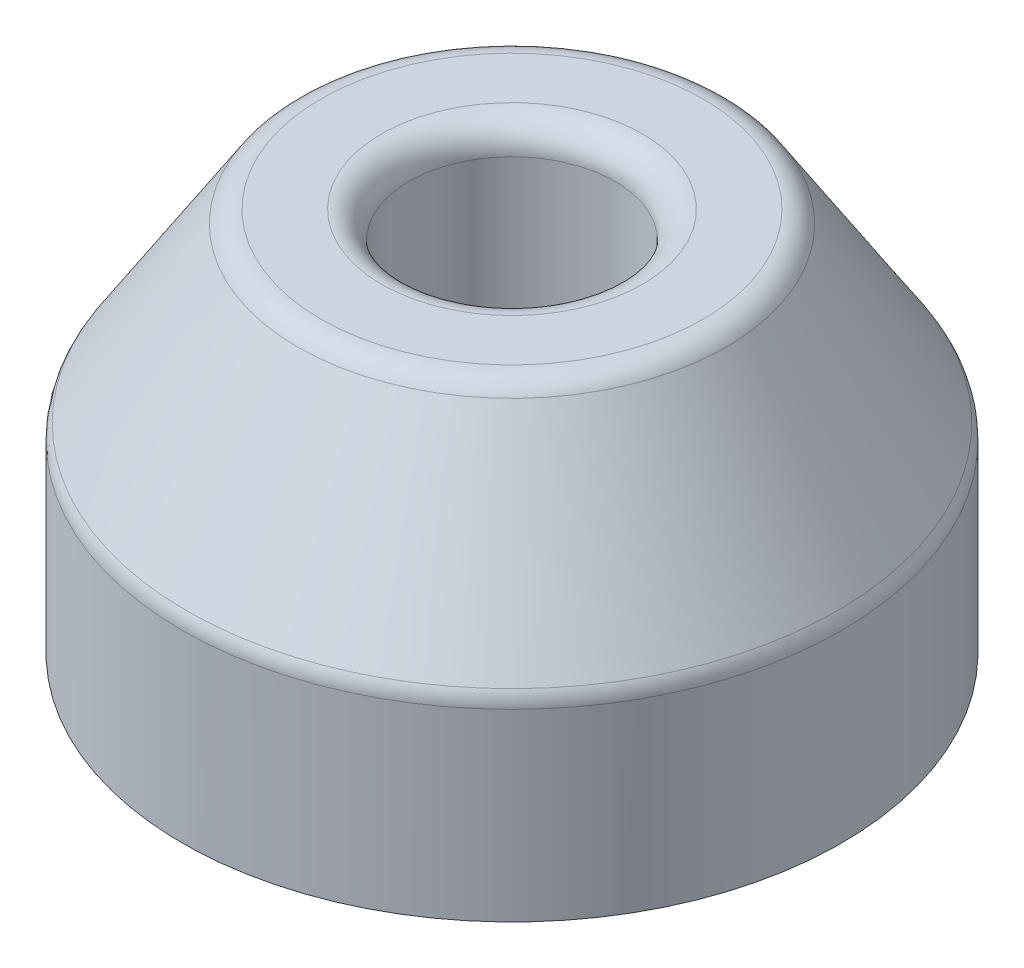
ISO-10303-21;
HEADER;
FILE_DESCRIPTION(('STEP AP214'),'2;1');
FILE_NAME('part.step','',(''),(''),'','','');
FILE_SCHEMA(('AUTOMOTIVE_DESIGN { 1 0 10303 214 1 1 1 1 }'));
ENDSEC;
DATA;
#1=APPLICATION_CONTEXT('core data for automotive mechanical design processes');
#2=APPLICATION_PROTOCOL_DEFINITION('international standard','automotive_design',2000,#1);
#3=PRODUCT_CONTEXT('',#1,'mechanical');
#4=PRODUCT('Part','Part','',(#3));
#5=PRODUCT_RELATED_PRODUCT_CATEGORY('part','',(#4));
#6=PRODUCT_DEFINITION_FORMATION('','',#4);
#7=PRODUCT_DEFINITION_CONTEXT('part definition',#1,'design');
#8=PRODUCT_DEFINITION('design','',#6,#7);
#9=PRODUCT_DEFINITION_SHAPE('','',#8);
#10=(LENGTH_UNIT() NAMED_UNIT(*) SI_UNIT(.MILLI.,.METRE.));
#11=(NAMED_UNIT(*) PLANE_ANGLE_UNIT() SI_UNIT($,.RADIAN.));
#12=(NAMED_UNIT(*) SI_UNIT($,.STERADIAN.) SOLID_ANGLE_UNIT());
#13=UNCERTAINTY_MEASURE_WITH_UNIT(LENGTH_MEASURE(1.E-05),#10,'distance_accuracy_value','');
#14=(GEOMETRIC_REPRESENTATION_CONTEXT(3) GLOBAL_UNCERTAINTY_ASSIGNED_CONTEXT((#13)) GLOBAL_UNIT_ASSIGNED_CONTEXT((#10,
#11,#12)) REPRESENTATION_CONTEXT('',''));
#15=CARTESIAN_POINT('',(0.,0.,0.));
#16=DIRECTION('',(0.,0.,1.));
#17=DIRECTION('',(1.,0.,0.));
#18=AXIS2_PLACEMENT_3D('',#15,#16,#17);
#19=CARTESIAN_POINT('',(0.,0.,0.));
#20=DIRECTION('',(0.,-1.,0.));
#21=DIRECTION('',(0.,0.,-1.));
#22=AXIS2_PLACEMENT_3D('',#19,#20,#21);
#23=PLANE('',#22);
#24=CARTESIAN_POINT('',(0.,0.,0.));
#25=DIRECTION('',(0.,-1.,0.));
#26=DIRECTION('',(0.,0.,-1.));
#27=AXIS2_PLACEMENT_3D('',#24,#25,#26);
#28=CIRCLE('',#27,12.);
#29=CARTESIAN_POINT('',(0.,0.,-12.));
#30=VERTEX_POINT('',#29);
#31=EDGE_CURVE('E69',#30,#30,#28,.T.);
#32=ORIENTED_EDGE('',*,*,#31,.T.);
#33=EDGE_LOOP('',(#32));
#34=FACE_BOUND('',#33,.T.);
#35=ADVANCED_FACE('F37',(#34),#23,.T.);
#36=CARTESIAN_POINT('',(0.,-9.98767788689747,0.));
#37=DIRECTION('',(0.,-1.,0.));
#38=DIRECTION('',(0.,0.,-1.));
#39=AXIS2_PLACEMENT_3D('',#36,#37,#38);
#40=CYLINDRICAL_SURFACE('',#39,12.);
#41=CARTESIAN_POINT('',(0.,6.70629811365631,0.));
#42=DIRECTION('',(0.,1.,0.));
#43=DIRECTION('',(0.,0.,1.));
#44=AXIS2_PLACEMENT_3D('',#41,#42,#43);
#45=CIRCLE('',#44,12.);
#46=CARTESIAN_POINT('',(0.,6.70629811365631,12.));
#47=VERTEX_POINT('',#46);
#48=EDGE_CURVE('E10',#47,#47,#45,.F.);
#49=ORIENTED_EDGE('',*,*,#48,.T.);
#50=EDGE_LOOP('',(#49));
#51=FACE_BOUND('',#50,.T.);
#52=ORIENTED_EDGE('',*,*,#31,.F.);
#53=EDGE_LOOP('',(#52));
#54=FACE_BOUND('',#53,.T.);
#55=ADVANCED_FACE('F95',(#51,#54),#40,.T.);
#56=CARTESIAN_POINT('',(0.,7.,0.));
#57=DIRECTION('',(0.,-1.,0.));
#58=DIRECTION('',(0.,0.,-1.));
#59=AXIS2_PLACEMENT_3D('',#56,#57,#58);
#60=CONICAL_SURFACE('',#59,12.,0.571337479833627);
#61=CARTESIAN_POINT('',(0.,13.5407575913135,0.));
#62=DIRECTION('',(0.,1.,0.));
#63=DIRECTION('',(0.,0.,1.));
#64=AXIS2_PLACEMENT_3D('',#61,#62,#63);
#65=CIRCLE('',#64,7.79522726272703);
#66=CARTESIAN_POINT('',(0.,13.5407575913135,7.79522726272703));
#67=VERTEX_POINT('',#66);
#68=EDGE_CURVE('E45',#67,#67,#65,.F.);
#69=ORIENTED_EDGE('',*,*,#68,.T.);
#70=EDGE_LOOP('',(#69));
#71=FACE_BOUND('',#70,.T.);
#72=CARTESIAN_POINT('',(0.,7.2470557049698,0.));
#73=DIRECTION('',(0.,1.,0.));
#74=DIRECTION('',(0.,0.,1.));
#75=AXIS2_PLACEMENT_3D('',#72,#73,#74);
#76=CIRCLE('',#75,11.8411784753766);
#77=CARTESIAN_POINT('',(0.,7.2470557049698,11.8411784753766));
#78=VERTEX_POINT('',#77);
#79=EDGE_CURVE('E50',#78,#78,#76,.T.);
#80=ORIENTED_EDGE('',*,*,#79,.T.);
#81=EDGE_LOOP('',(#80));
#82=FACE_BOUND('',#81,.T.);
#83=ADVANCED_FACE('F91',(#71,#82),#60,.T.);
#84=CARTESIAN_POINT('',(7.5,14.,0.));
#85=DIRECTION('',(0.,1.,0.));
#86=DIRECTION('',(0.,0.,1.));
#87=AXIS2_PLACEMENT_3D('',#84,#85,#86);
#88=PLANE('',#87);
#89=CARTESIAN_POINT('',(0.,14.,0.));
#90=DIRECTION('',(0.,1.,0.));
#91=DIRECTION('',(0.,0.,1.));
#92=AXIS2_PLACEMENT_3D('',#89,#90,#91);
#93=CIRCLE('',#92,4.75);
#94=CARTESIAN_POINT('',(0.,14.,4.75));
#95=VERTEX_POINT('',#94);
#96=EDGE_CURVE('E55',#95,#95,#93,.F.);
#97=ORIENTED_EDGE('',*,*,#96,.T.);
#98=EDGE_LOOP('',(#97));
#99=FACE_BOUND('',#98,.T.);
#100=CARTESIAN_POINT('',(0.,14.,0.));
#101=DIRECTION('',(0.,1.,0.));
#102=DIRECTION('',(0.,0.,1.));
#103=AXIS2_PLACEMENT_3D('',#100,#101,#102);
#104=CIRCLE('',#103,6.95404878735048);
#105=CARTESIAN_POINT('',(0.,14.,6.95404878735048));
#106=VERTEX_POINT('',#105);
#107=EDGE_CURVE('E61',#106,#106,#104,.T.);
#108=ORIENTED_EDGE('',*,*,#107,.T.);
#109=EDGE_LOOP('',(#108));
#110=FACE_BOUND('',#109,.T.);
#111=ADVANCED_FACE('F82',(#99,#110),#88,.T.);
#112=CARTESIAN_POINT('',(0.,6.,0.));
#113=DIRECTION('',(0.,1.,0.));
#114=DIRECTION('',(0.,0.,1.));
#115=AXIS2_PLACEMENT_3D('',#112,#113,#114);
#116=CYLINDRICAL_SURFACE('',#115,3.75);
#117=CARTESIAN_POINT('',(0.,13.,0.));
#118=DIRECTION('',(0.,1.,0.));
#119=DIRECTION('',(0.,0.,1.));
#120=AXIS2_PLACEMENT_3D('',#117,#118,#119);
#121=CIRCLE('',#120,3.75);
#122=CARTESIAN_POINT('',(0.,13.,3.75));
#123=VERTEX_POINT('',#122);
#124=EDGE_CURVE('E65',#123,#123,#121,.T.);
#125=ORIENTED_EDGE('',*,*,#124,.T.);
#126=EDGE_LOOP('',(#125));
#127=FACE_BOUND('',#126,.T.);
#128=CARTESIAN_POINT('',(0.,6.,0.));
#129=DIRECTION('',(0.,1.,0.));
#130=DIRECTION('',(0.,0.,1.));
#131=AXIS2_PLACEMENT_3D('',#128,#129,#130);
#132=CIRCLE('',#131,3.75);
#133=CARTESIAN_POINT('',(0.,6.,3.75));
#134=VERTEX_POINT('',#133);
#135=EDGE_CURVE('E73',#134,#134,#132,.T.);
#136=ORIENTED_EDGE('',*,*,#135,.F.);
#137=EDGE_LOOP('',(#136));
#138=FACE_BOUND('',#137,.T.);
#139=ADVANCED_FACE('F80',(#127,#138),#116,.F.);
#140=CARTESIAN_POINT('',(0.,6.,0.));
#141=DIRECTION('',(0.,1.,0.));
#142=DIRECTION('',(0.,0.,1.));
#143=AXIS2_PLACEMENT_3D('',#140,#141,#142);
#144=PLANE('',#143);
#145=ORIENTED_EDGE('',*,*,#135,.T.);
#146=EDGE_LOOP('',(#145));
#147=FACE_BOUND('',#146,.T.);
#148=ADVANCED_FACE('F78',(#147),#144,.T.);
#149=CARTESIAN_POINT('',(0.,13.,0.));
#150=DIRECTION('',(0.,1.,0.));
#151=DIRECTION('',(0.,0.,1.));
#152=AXIS2_PLACEMENT_3D('',#149,#150,#151);
#153=TOROIDAL_SURFACE('',#152,4.75,0.999999999999997);
#154=ORIENTED_EDGE('',*,*,#96,.F.);
#155=EDGE_LOOP('',(#154));
#156=FACE_BOUND('',#155,.T.);
#157=ORIENTED_EDGE('',*,*,#124,.F.);
#158=EDGE_LOOP('',(#157));
#159=FACE_BOUND('',#158,.T.);
#160=ADVANCED_FACE('F89',(#156,#159),#153,.T.);
#161=CARTESIAN_POINT('',(0.,13.,0.));
#162=DIRECTION('',(0.,1.,0.));
#163=DIRECTION('',(0.,0.,1.));
#164=AXIS2_PLACEMENT_3D('',#161,#162,#163);
#165=TOROIDAL_SURFACE('',#164,6.95404878735048,0.999999999999997);
#166=ORIENTED_EDGE('',*,*,#107,.F.);
#167=EDGE_LOOP('',(#166));
#168=FACE_BOUND('',#167,.T.);
#169=ORIENTED_EDGE('',*,*,#68,.F.);
#170=EDGE_LOOP('',(#169));
#171=FACE_BOUND('',#170,.T.);
#172=ADVANCED_FACE('F105',(#168,#171),#165,.T.);
#173=CARTESIAN_POINT('',(0.,6.70629811365631,0.));
#174=DIRECTION('',(0.,1.,0.));
#175=DIRECTION('',(0.,0.,1.));
#176=AXIS2_PLACEMENT_3D('',#173,#174,#175);
#177=TOROIDAL_SURFACE('',#176,11.,0.999999999999997);
#178=ORIENTED_EDGE('',*,*,#79,.F.);
#179=EDGE_LOOP('',(#178));
#180=FACE_BOUND('',#179,.T.);
#181=ORIENTED_EDGE('',*,*,#48,.F.);
#182=EDGE_LOOP('',(#181));
#183=FACE_BOUND('',#182,.T.);
#184=ADVANCED_FACE('F39',(#180,#183),#177,.T.);
#185=CLOSED_SHELL('',(#35,#55,#83,#111,#139,#148,#160,#172,#184));
#186=MANIFOLD_SOLID_BREP('B2',#185);
#187=ADVANCED_BREP_SHAPE_REPRESENTATION('',(#18,#186),#14);
#188=SHAPE_DEFINITION_REPRESENTATION(#9,#187);
ENDSEC;
END-ISO-10303-21;
